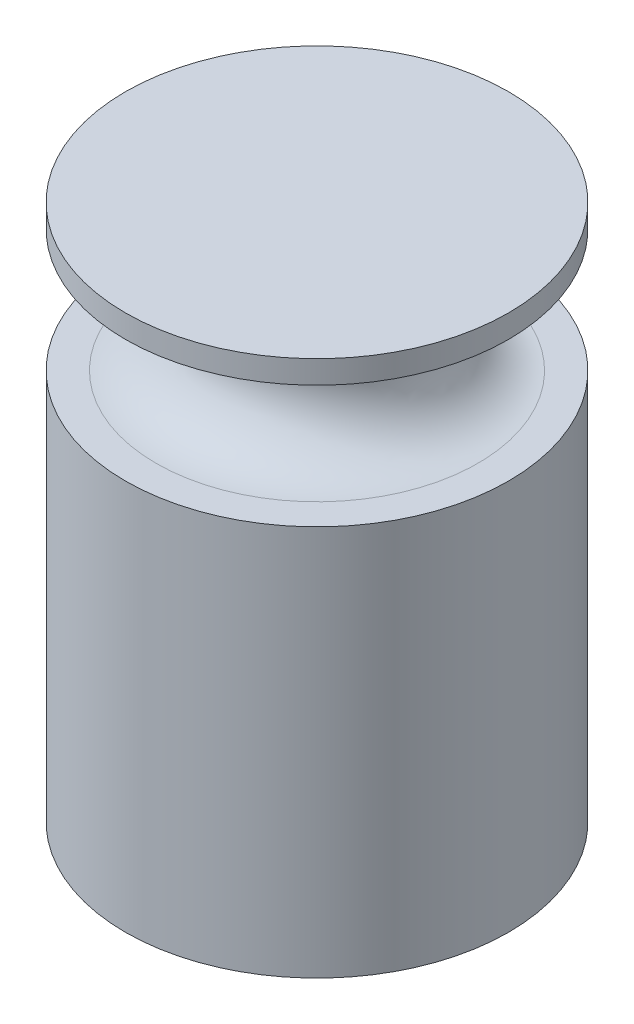
ISO-10303-21;
HEADER;
FILE_DESCRIPTION(('STEP AP214'),'2;1');
FILE_NAME('part.step','',(''),(''),'','','');
FILE_SCHEMA(('AUTOMOTIVE_DESIGN { 1 0 10303 214 1 1 1 1 }'));
ENDSEC;
DATA;
#1=APPLICATION_CONTEXT('core data for automotive mechanical design processes');
#2=APPLICATION_PROTOCOL_DEFINITION('international standard','automotive_design',2000,#1);
#3=PRODUCT_CONTEXT('',#1,'mechanical');
#4=PRODUCT('Part','Part','',(#3));
#5=PRODUCT_RELATED_PRODUCT_CATEGORY('part','',(#4));
#6=PRODUCT_DEFINITION_FORMATION('','',#4);
#7=PRODUCT_DEFINITION_CONTEXT('part definition',#1,'design');
#8=PRODUCT_DEFINITION('design','',#6,#7);
#9=PRODUCT_DEFINITION_SHAPE('','',#8);
#10=(LENGTH_UNIT() NAMED_UNIT(*) SI_UNIT(.MILLI.,.METRE.));
#11=(NAMED_UNIT(*) PLANE_ANGLE_UNIT() SI_UNIT($,.RADIAN.));
#12=(NAMED_UNIT(*) SI_UNIT($,.STERADIAN.) SOLID_ANGLE_UNIT());
#13=UNCERTAINTY_MEASURE_WITH_UNIT(LENGTH_MEASURE(1.E-05),#10,'distance_accuracy_value','');
#14=(GEOMETRIC_REPRESENTATION_CONTEXT(3) GLOBAL_UNCERTAINTY_ASSIGNED_CONTEXT((#13)) GLOBAL_UNIT_ASSIGNED_CONTEXT((#10,
#11,#12)) REPRESENTATION_CONTEXT('',''));
#15=CARTESIAN_POINT('',(0.,0.,0.));
#16=DIRECTION('',(0.,0.,1.));
#17=DIRECTION('',(1.,0.,0.));
#18=AXIS2_PLACEMENT_3D('',#15,#16,#17);
#19=CARTESIAN_POINT('',(0.,0.,0.));
#20=DIRECTION('',(0.,-1.,0.));
#21=DIRECTION('',(0.,0.,-1.));
#22=AXIS2_PLACEMENT_3D('',#19,#20,#21);
#23=PLANE('',#22);
#24=CARTESIAN_POINT('',(0.,0.,0.));
#25=DIRECTION('',(0.,-1.,0.));
#26=DIRECTION('',(0.,0.,-1.));
#27=AXIS2_PLACEMENT_3D('',#24,#25,#26);
#28=CIRCLE('',#27,25.);
#29=CARTESIAN_POINT('',(0.,0.,-25.));
#30=VERTEX_POINT('',#29);
#31=EDGE_CURVE('E11',#30,#30,#28,.T.);
#32=ORIENTED_EDGE('',*,*,#31,.T.);
#33=EDGE_LOOP('',(#32));
#34=FACE_BOUND('',#33,.T.);
#35=ADVANCED_FACE('F36',(#34),#23,.T.);
#36=CARTESIAN_POINT('',(0.,0.,0.));
#37=DIRECTION('',(0.,-1.,0.));
#38=DIRECTION('',(0.,0.,-1.));
#39=AXIS2_PLACEMENT_3D('',#36,#37,#38);
#40=CYLINDRICAL_SURFACE('',#39,25.);
#41=CARTESIAN_POINT('',(0.,51.,0.));
#42=DIRECTION('',(0.,-1.,0.));
#43=DIRECTION('',(0.,0.,-1.));
#44=AXIS2_PLACEMENT_3D('',#41,#42,#43);
#45=CIRCLE('',#44,25.);
#46=CARTESIAN_POINT('',(0.,51.,-25.));
#47=VERTEX_POINT('',#46);
#48=EDGE_CURVE('E42',#47,#47,#45,.T.);
#49=ORIENTED_EDGE('',*,*,#48,.T.);
#50=EDGE_LOOP('',(#49));
#51=FACE_BOUND('',#50,.T.);
#52=ORIENTED_EDGE('',*,*,#31,.F.);
#53=EDGE_LOOP('',(#52));
#54=FACE_BOUND('',#53,.T.);
#55=ADVANCED_FACE('F74',(#51,#54),#40,.T.);
#56=CARTESIAN_POINT('',(25.,51.,0.));
#57=DIRECTION('',(0.,1.,0.));
#58=DIRECTION('',(0.,0.,1.));
#59=AXIS2_PLACEMENT_3D('',#56,#57,#58);
#60=PLANE('',#59);
#61=CARTESIAN_POINT('',(0.,51.,0.));
#62=DIRECTION('',(0.,-1.,0.));
#63=DIRECTION('',(0.,0.,-1.));
#64=AXIS2_PLACEMENT_3D('',#61,#62,#63);
#65=CIRCLE('',#64,21.);
#66=CARTESIAN_POINT('',(0.,51.,-21.));
#67=VERTEX_POINT('',#66);
#68=EDGE_CURVE('E46',#67,#67,#65,.T.);
#69=ORIENTED_EDGE('',*,*,#68,.T.);
#70=EDGE_LOOP('',(#69));
#71=FACE_BOUND('',#70,.T.);
#72=ORIENTED_EDGE('',*,*,#48,.F.);
#73=EDGE_LOOP('',(#72));
#74=FACE_BOUND('',#73,.T.);
#75=ADVANCED_FACE('F78',(#71,#74),#60,.T.);
#76=CARTESIAN_POINT('',(0.,59.,0.));
#77=DIRECTION('',(0.,-1.,0.));
#78=DIRECTION('',(0.,0.,-1.));
#79=AXIS2_PLACEMENT_3D('',#76,#77,#78);
#80=TOROIDAL_SURFACE('',#79,21.,8.00000000000001);
#81=CARTESIAN_POINT('',(0.,67.,0.));
#82=DIRECTION('',(0.,-1.,0.));
#83=DIRECTION('',(0.,0.,-1.));
#84=AXIS2_PLACEMENT_3D('',#81,#82,#83);
#85=CIRCLE('',#84,21.);
#86=CARTESIAN_POINT('',(0.,67.,-21.));
#87=VERTEX_POINT('',#86);
#88=EDGE_CURVE('E50',#87,#87,#85,.T.);
#89=ORIENTED_EDGE('',*,*,#88,.T.);
#90=EDGE_LOOP('',(#89));
#91=FACE_BOUND('',#90,.T.);
#92=ORIENTED_EDGE('',*,*,#68,.F.);
#93=EDGE_LOOP('',(#92));
#94=FACE_BOUND('',#93,.T.);
#95=ADVANCED_FACE('F82',(#91,#94),#80,.F.);
#96=CARTESIAN_POINT('',(25.,67.,0.));
#97=DIRECTION('',(0.,-1.,0.));
#98=DIRECTION('',(0.,0.,-1.));
#99=AXIS2_PLACEMENT_3D('',#96,#97,#98);
#100=PLANE('',#99);
#101=CARTESIAN_POINT('',(0.,67.,0.));
#102=DIRECTION('',(0.,-1.,0.));
#103=DIRECTION('',(0.,0.,-1.));
#104=AXIS2_PLACEMENT_3D('',#101,#102,#103);
#105=CIRCLE('',#104,25.);
#106=CARTESIAN_POINT('',(0.,67.,-25.));
#107=VERTEX_POINT('',#106);
#108=EDGE_CURVE('E55',#107,#107,#105,.T.);
#109=ORIENTED_EDGE('',*,*,#108,.T.);
#110=EDGE_LOOP('',(#109));
#111=FACE_BOUND('',#110,.T.);
#112=ORIENTED_EDGE('',*,*,#88,.F.);
#113=EDGE_LOOP('',(#112));
#114=FACE_BOUND('',#113,.T.);
#115=ADVANCED_FACE('F71',(#111,#114),#100,.T.);
#116=CARTESIAN_POINT('',(0.,0.,0.));
#117=DIRECTION('',(0.,-1.,0.));
#118=DIRECTION('',(0.,0.,-1.));
#119=AXIS2_PLACEMENT_3D('',#116,#117,#118);
#120=CYLINDRICAL_SURFACE('',#119,25.);
#121=CARTESIAN_POINT('',(0.,70.,0.));
#122=DIRECTION('',(0.,-1.,0.));
#123=DIRECTION('',(0.,0.,-1.));
#124=AXIS2_PLACEMENT_3D('',#121,#122,#123);
#125=CIRCLE('',#124,25.);
#126=CARTESIAN_POINT('',(0.,70.,-25.));
#127=VERTEX_POINT('',#126);
#128=EDGE_CURVE('E58',#127,#127,#125,.T.);
#129=ORIENTED_EDGE('',*,*,#128,.T.);
#130=EDGE_LOOP('',(#129));
#131=FACE_BOUND('',#130,.T.);
#132=ORIENTED_EDGE('',*,*,#108,.F.);
#133=EDGE_LOOP('',(#132));
#134=FACE_BOUND('',#133,.T.);
#135=ADVANCED_FACE('F62',(#131,#134),#120,.T.);
#136=CARTESIAN_POINT('',(0.,70.,0.));
#137=DIRECTION('',(0.,1.,0.));
#138=DIRECTION('',(0.,0.,1.));
#139=AXIS2_PLACEMENT_3D('',#136,#137,#138);
#140=PLANE('',#139);
#141=ORIENTED_EDGE('',*,*,#128,.F.);
#142=EDGE_LOOP('',(#141));
#143=FACE_BOUND('',#142,.T.);
#144=ADVANCED_FACE('F65',(#143),#140,.T.);
#145=CLOSED_SHELL('',(#35,#55,#75,#95,#115,#135,#144));
#146=MANIFOLD_SOLID_BREP('B2',#145);
#147=ADVANCED_BREP_SHAPE_REPRESENTATION('',(#18,#146),#14);
#148=SHAPE_DEFINITION_REPRESENTATION(#9,#147);
ENDSEC;
END-ISO-10303-21;
